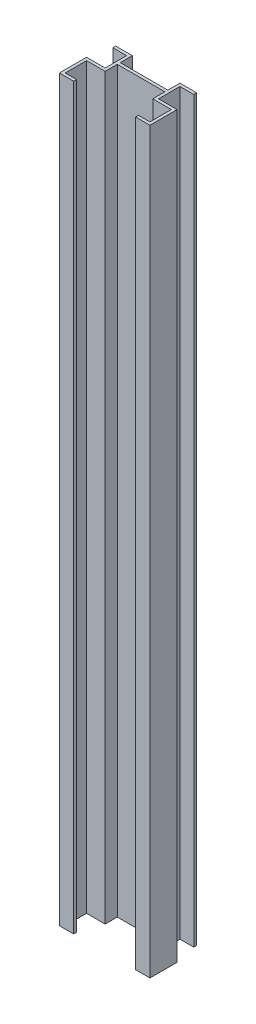
ISO-10303-21;
HEADER;
FILE_DESCRIPTION(('STEP AP214'),'2;1');
FILE_NAME('part.step','',(''),(''),'','','');
FILE_SCHEMA(('AUTOMOTIVE_DESIGN { 1 0 10303 214 1 1 1 1 }'));
ENDSEC;
DATA;
#1=APPLICATION_CONTEXT('core data for automotive mechanical design processes');
#2=APPLICATION_PROTOCOL_DEFINITION('international standard','automotive_design',2000,#1);
#3=PRODUCT_CONTEXT('',#1,'mechanical');
#4=PRODUCT('Part','Part','',(#3));
#5=PRODUCT_RELATED_PRODUCT_CATEGORY('part','',(#4));
#6=PRODUCT_DEFINITION_FORMATION('','',#4);
#7=PRODUCT_DEFINITION_CONTEXT('part definition',#1,'design');
#8=PRODUCT_DEFINITION('design','',#6,#7);
#9=PRODUCT_DEFINITION_SHAPE('','',#8);
#10=(LENGTH_UNIT() NAMED_UNIT(*) SI_UNIT(.MILLI.,.METRE.));
#11=(NAMED_UNIT(*) PLANE_ANGLE_UNIT() SI_UNIT($,.RADIAN.));
#12=(NAMED_UNIT(*) SI_UNIT($,.STERADIAN.) SOLID_ANGLE_UNIT());
#13=UNCERTAINTY_MEASURE_WITH_UNIT(LENGTH_MEASURE(1.E-05),#10,'distance_accuracy_value','');
#14=(GEOMETRIC_REPRESENTATION_CONTEXT(3) GLOBAL_UNCERTAINTY_ASSIGNED_CONTEXT((#13)) GLOBAL_UNIT_ASSIGNED_CONTEXT((#10,
#11,#12)) REPRESENTATION_CONTEXT('',''));
#15=CARTESIAN_POINT('',(0.,0.,0.));
#16=DIRECTION('',(0.,0.,1.));
#17=DIRECTION('',(1.,0.,0.));
#18=AXIS2_PLACEMENT_3D('',#15,#16,#17);
#19=CARTESIAN_POINT('',(-56.,-5.00000001402157E-05,-51.));
#20=DIRECTION('',(1.,0.,0.));
#21=DIRECTION('',(0.,0.,-1.));
#22=AXIS2_PLACEMENT_3D('',#19,#20,#21);
#23=PLANE('',#22);
#24=DIRECTION('',(0.,0.,1.));
#25=VECTOR('',#24,1.);
#26=CARTESIAN_POINT('',(-56.,1550.,-51.));
#27=LINE('',#26,#25);
#28=CARTESIAN_POINT('',(-56.,1550.,-96.));
#29=VERTEX_POINT('',#28);
#30=CARTESIAN_POINT('',(-56.,1550.,-51.));
#31=VERTEX_POINT('',#30);
#32=EDGE_CURVE('E421',#29,#31,#27,.T.);
#33=ORIENTED_EDGE('',*,*,#32,.F.);
#34=DIRECTION('',(0.,1.,0.));
#35=VECTOR('',#34,1.);
#36=CARTESIAN_POINT('',(-56.,2350.,-96.));
#37=LINE('',#36,#35);
#38=CARTESIAN_POINT('',(-56.,0.,-96.));
#39=VERTEX_POINT('',#38);
#40=EDGE_CURVE('E232',#39,#29,#37,.T.);
#41=ORIENTED_EDGE('',*,*,#40,.F.);
#42=DIRECTION('',(0.,0.,1.));
#43=VECTOR('',#42,1.);
#44=CARTESIAN_POINT('',(-56.,0.,-44.9999999999998));
#45=LINE('',#44,#43);
#46=CARTESIAN_POINT('',(-56.,0.,-51.));
#47=VERTEX_POINT('',#46);
#48=EDGE_CURVE('E253',#39,#47,#45,.T.);
#49=ORIENTED_EDGE('',*,*,#48,.T.);
#50=DIRECTION('',(0.,1.,0.));
#51=VECTOR('',#50,1.);
#52=CARTESIAN_POINT('',(-56.,-5.00000001402157E-05,-51.));
#53=LINE('',#52,#51);
#54=EDGE_CURVE('E250',#47,#31,#53,.T.);
#55=ORIENTED_EDGE('',*,*,#54,.T.);
#56=EDGE_LOOP('',(#33,#41,#49,#55));
#57=FACE_BOUND('',#56,.T.);
#58=ADVANCED_FACE('F35',(#57),#23,.F.);
#59=CARTESIAN_POINT('',(0.,0.,-76.5));
#60=DIRECTION('',(0.,0.,-1.));
#61=DIRECTION('',(-1.,0.,0.));
#62=AXIS2_PLACEMENT_3D('',#59,#60,#61);
#63=PLANE('',#62);
#64=DIRECTION('',(0.,-1.,0.));
#65=VECTOR('',#64,1.);
#66=CARTESIAN_POINT('',(-50.0000000000004,0.,-76.5000000000002));
#67=LINE('',#66,#65);
#68=CARTESIAN_POINT('',(-50.,1550.,-76.5000000000002));
#69=VERTEX_POINT('',#68);
#70=CARTESIAN_POINT('',(-50.0000000000004,0.,-76.5000000000002));
#71=VERTEX_POINT('',#70);
#72=EDGE_CURVE('E259',#69,#71,#67,.T.);
#73=ORIENTED_EDGE('',*,*,#72,.F.);
#74=DIRECTION('',(1.,0.,0.));
#75=VECTOR('',#74,1.);
#76=CARTESIAN_POINT('',(0.,1550.,-76.5));
#77=LINE('',#76,#75);
#78=CARTESIAN_POINT('',(49.9999999999997,1550.,-76.4999999999999));
#79=VERTEX_POINT('',#78);
#80=EDGE_CURVE('E425',#69,#79,#77,.T.);
#81=ORIENTED_EDGE('',*,*,#80,.T.);
#82=DIRECTION('',(0.,1.,0.));
#83=VECTOR('',#82,1.);
#84=CARTESIAN_POINT('',(49.9999999999997,2350.,-76.4999999999998));
#85=LINE('',#84,#83);
#86=CARTESIAN_POINT('',(49.9999999999997,0.,-76.5));
#87=VERTEX_POINT('',#86);
#88=EDGE_CURVE('E289',#87,#79,#85,.T.);
#89=ORIENTED_EDGE('',*,*,#88,.F.);
#90=DIRECTION('',(-1.,0.,0.));
#91=VECTOR('',#90,1.);
#92=CARTESIAN_POINT('',(95.,0.,-76.5));
#93=LINE('',#92,#91);
#94=EDGE_CURVE('E375',#87,#71,#93,.T.);
#95=ORIENTED_EDGE('',*,*,#94,.T.);
#96=EDGE_LOOP('',(#73,#81,#89,#95));
#97=FACE_BOUND('',#96,.T.);
#98=ADVANCED_FACE('F504',(#97),#63,.T.);
#99=CARTESIAN_POINT('',(56.,2350.,-51.));
#100=DIRECTION('',(-1.,0.,0.));
#101=DIRECTION('',(0.,0.,1.));
#102=AXIS2_PLACEMENT_3D('',#99,#100,#101);
#103=PLANE('',#102);
#104=DIRECTION('',(0.,0.,-1.));
#105=VECTOR('',#104,1.);
#106=CARTESIAN_POINT('',(56.,1550.,-51.));
#107=LINE('',#106,#105);
#108=CARTESIAN_POINT('',(56.,1550.,-51.));
#109=VERTEX_POINT('',#108);
#110=CARTESIAN_POINT('',(56.,1550.,-96.));
#111=VERTEX_POINT('',#110);
#112=EDGE_CURVE('E455',#109,#111,#107,.T.);
#113=ORIENTED_EDGE('',*,*,#112,.F.);
#114=DIRECTION('',(0.,-1.,0.));
#115=VECTOR('',#114,1.);
#116=CARTESIAN_POINT('',(56.,2350.,-51.));
#117=LINE('',#116,#115);
#118=CARTESIAN_POINT('',(56.,0.,-51.));
#119=VERTEX_POINT('',#118);
#120=EDGE_CURVE('E287',#109,#119,#117,.T.);
#121=ORIENTED_EDGE('',*,*,#120,.T.);
#122=DIRECTION('',(0.,0.,-1.));
#123=VECTOR('',#122,1.);
#124=CARTESIAN_POINT('',(56.,0.,-51.));
#125=LINE('',#124,#123);
#126=CARTESIAN_POINT('',(56.,0.,-96.));
#127=VERTEX_POINT('',#126);
#128=EDGE_CURVE('E284',#119,#127,#125,.T.);
#129=ORIENTED_EDGE('',*,*,#128,.T.);
#130=DIRECTION('',(0.,-1.,0.));
#131=VECTOR('',#130,1.);
#132=CARTESIAN_POINT('',(56.,0.,-96.));
#133=LINE('',#132,#131);
#134=EDGE_CURVE('E57',#111,#127,#133,.T.);
#135=ORIENTED_EDGE('',*,*,#134,.F.);
#136=EDGE_LOOP('',(#113,#121,#129,#135));
#137=FACE_BOUND('',#136,.T.);
#138=ADVANCED_FACE('F496',(#137),#103,.F.);
#139=CARTESIAN_POINT('',(-95.0000000000001,2350.,-70.4999999999997));
#140=DIRECTION('',(0.,0.,-1.));
#141=DIRECTION('',(-1.,0.,0.));
#142=AXIS2_PLACEMENT_3D('',#139,#140,#141);
#143=PLANE('',#142);
#144=DIRECTION('',(1.,0.,0.));
#145=VECTOR('',#144,1.);
#146=CARTESIAN_POINT('',(-95.0000000000001,1550.,-70.4999999999997));
#147=LINE('',#146,#145);
#148=CARTESIAN_POINT('',(-50.,1550.,-70.4999999999999));
#149=VERTEX_POINT('',#148);
#150=CARTESIAN_POINT('',(49.9999999999999,1550.,-70.4999999999997));
#151=VERTEX_POINT('',#150);
#152=EDGE_CURVE('E406',#149,#151,#147,.T.);
#153=ORIENTED_EDGE('',*,*,#152,.F.);
#154=DIRECTION('',(0.,1.,0.));
#155=VECTOR('',#154,1.);
#156=CARTESIAN_POINT('',(-50.,2350.,-70.4999999999997));
#157=LINE('',#156,#155);
#158=CARTESIAN_POINT('',(-50.,0.,-70.4999999999997));
#159=VERTEX_POINT('',#158);
#160=EDGE_CURVE('E347',#159,#149,#157,.T.);
#161=ORIENTED_EDGE('',*,*,#160,.F.);
#162=DIRECTION('',(1.,0.,0.));
#163=VECTOR('',#162,1.);
#164=CARTESIAN_POINT('',(-95.0000000000001,0.,-70.4999999999997));
#165=LINE('',#164,#163);
#166=CARTESIAN_POINT('',(49.9999999999999,0.,-70.4999999999997));
#167=VERTEX_POINT('',#166);
#168=EDGE_CURVE('E361',#159,#167,#165,.T.);
#169=ORIENTED_EDGE('',*,*,#168,.T.);
#170=DIRECTION('',(0.,1.,0.));
#171=VECTOR('',#170,1.);
#172=CARTESIAN_POINT('',(49.9999999999999,2350.,-70.4999999999997));
#173=LINE('',#172,#171);
#174=EDGE_CURVE('E357',#167,#151,#173,.T.);
#175=ORIENTED_EDGE('',*,*,#174,.T.);
#176=EDGE_LOOP('',(#153,#161,#169,#175));
#177=FACE_BOUND('',#176,.T.);
#178=ADVANCED_FACE('F494',(#177),#143,.F.);
#179=CARTESIAN_POINT('',(-50.,2350.,6.00000000000024));
#180=DIRECTION('',(-1.,0.,0.));
#181=DIRECTION('',(0.,0.,1.));
#182=AXIS2_PLACEMENT_3D('',#179,#180,#181);
#183=PLANE('',#182);
#184=DIRECTION('',(0.,0.,-1.));
#185=VECTOR('',#184,1.);
#186=CARTESIAN_POINT('',(-50.,1550.,6.00000000000024));
#187=LINE('',#186,#185);
#188=CARTESIAN_POINT('',(-50.,1550.,-45.));
#189=VERTEX_POINT('',#188);
#190=EDGE_CURVE('E409',#189,#149,#187,.T.);
#191=ORIENTED_EDGE('',*,*,#190,.F.);
#192=DIRECTION('',(0.,1.,0.));
#193=VECTOR('',#192,1.);
#194=CARTESIAN_POINT('',(-50.,0.,-45.));
#195=LINE('',#194,#193);
#196=CARTESIAN_POINT('',(-50.,0.,-45.));
#197=VERTEX_POINT('',#196);
#198=EDGE_CURVE('E306',#197,#189,#195,.T.);
#199=ORIENTED_EDGE('',*,*,#198,.F.);
#200=DIRECTION('',(0.,0.,-1.));
#201=VECTOR('',#200,1.);
#202=CARTESIAN_POINT('',(-50.,0.,6.00000000000024));
#203=LINE('',#202,#201);
#204=EDGE_CURVE('E353',#197,#159,#203,.T.);
#205=ORIENTED_EDGE('',*,*,#204,.T.);
#206=ORIENTED_EDGE('',*,*,#160,.T.);
#207=EDGE_LOOP('',(#191,#199,#205,#206));
#208=FACE_BOUND('',#207,.T.);
#209=ADVANCED_FACE('F490',(#208),#183,.F.);
#210=CARTESIAN_POINT('',(-50.0000000000003,1550.,-102.));
#211=VERTEX_POINT('',#210);
#212=EDGE_CURVE('E428',#69,#211,#187,.T.);
#213=ORIENTED_EDGE('',*,*,#212,.F.);
#214=ORIENTED_EDGE('',*,*,#72,.T.);
#215=DIRECTION('',(0.,0.,1.));
#216=VECTOR('',#215,1.);
#217=CARTESIAN_POINT('',(-50.0000000000003,0.,-102.));
#218=LINE('',#217,#216);
#219=CARTESIAN_POINT('',(-50.0000000000003,0.,-102.));
#220=VERTEX_POINT('',#219);
#221=EDGE_CURVE('E265',#220,#71,#218,.T.);
#222=ORIENTED_EDGE('',*,*,#221,.F.);
#223=DIRECTION('',(0.,-1.,0.));
#224=VECTOR('',#223,1.);
#225=CARTESIAN_POINT('',(-50.0000000000003,0.,-102.));
#226=LINE('',#225,#224);
#227=EDGE_CURVE('E260',#211,#220,#226,.T.);
#228=ORIENTED_EDGE('',*,*,#227,.F.);
#229=EDGE_LOOP('',(#213,#214,#222,#228));
#230=FACE_BOUND('',#229,.T.);
#231=ADVANCED_FACE('F502',(#230),#183,.F.);
#232=CARTESIAN_POINT('',(88.9999999999998,0.,6.00000000000016));
#233=DIRECTION('',(1.,0.,0.));
#234=DIRECTION('',(0.,0.,-1.));
#235=AXIS2_PLACEMENT_3D('',#232,#233,#234);
#236=PLANE('',#235);
#237=DIRECTION('',(0.,0.,1.));
#238=VECTOR('',#237,1.);
#239=CARTESIAN_POINT('',(88.9999999999998,1550.,6.00000000000016));
#240=LINE('',#239,#238);
#241=CARTESIAN_POINT('',(88.9999999999998,1550.,-44.9999999999998));
#242=VERTEX_POINT('',#241);
#243=CARTESIAN_POINT('',(88.9999999999998,1550.,2.00805084366041E-12));
#244=VERTEX_POINT('',#243);
#245=EDGE_CURVE('E431',#242,#244,#240,.T.);
#246=ORIENTED_EDGE('',*,*,#245,.F.);
#247=DIRECTION('',(0.,-1.,0.));
#248=VECTOR('',#247,1.);
#249=CARTESIAN_POINT('',(88.9999999999998,0.,-44.9999999999998));
#250=LINE('',#249,#248);
#251=CARTESIAN_POINT('',(88.9999999999998,0.,-44.9999999999998));
#252=VERTEX_POINT('',#251);
#253=EDGE_CURVE('E336',#242,#252,#250,.T.);
#254=ORIENTED_EDGE('',*,*,#253,.T.);
#255=DIRECTION('',(0.,0.,-1.));
#256=VECTOR('',#255,1.);
#257=CARTESIAN_POINT('',(88.9999999999998,0.,6.00000000000016));
#258=LINE('',#257,#256);
#259=CARTESIAN_POINT('',(88.9999999999998,0.,2.00805084366041E-12));
#260=VERTEX_POINT('',#259);
#261=EDGE_CURVE('E343',#260,#252,#258,.T.);
#262=ORIENTED_EDGE('',*,*,#261,.F.);
#263=DIRECTION('',(0.,-1.,0.));
#264=VECTOR('',#263,1.);
#265=CARTESIAN_POINT('',(88.9999999999998,0.,2.00805084366041E-12));
#266=LINE('',#265,#264);
#267=EDGE_CURVE('E323',#244,#260,#266,.T.);
#268=ORIENTED_EDGE('',*,*,#267,.F.);
#269=EDGE_LOOP('',(#246,#254,#262,#268));
#270=FACE_BOUND('',#269,.T.);
#271=ADVANCED_FACE('F563',(#270),#236,.F.);
#272=CARTESIAN_POINT('',(0.,0.,-44.9999999999998));
#273=DIRECTION('',(0.,0.,-1.));
#274=DIRECTION('',(-1.,0.,0.));
#275=AXIS2_PLACEMENT_3D('',#272,#273,#274);
#276=PLANE('',#275);
#277=DIRECTION('',(1.,0.,0.));
#278=VECTOR('',#277,1.);
#279=CARTESIAN_POINT('',(0.,1550.,-44.9999999999998));
#280=LINE('',#279,#278);
#281=CARTESIAN_POINT('',(49.9999999999999,1550.,-44.9999999999999));
#282=VERTEX_POINT('',#281);
#283=EDGE_CURVE('E241',#282,#242,#280,.T.);
#284=ORIENTED_EDGE('',*,*,#283,.F.);
#285=DIRECTION('',(0.,1.,0.));
#286=VECTOR('',#285,1.);
#287=CARTESIAN_POINT('',(49.9999999999999,0.,-44.9999999999999));
#288=LINE('',#287,#286);
#289=CARTESIAN_POINT('',(49.9999999999999,0.,-44.9999999999999));
#290=VERTEX_POINT('',#289);
#291=EDGE_CURVE('E380',#290,#282,#288,.T.);
#292=ORIENTED_EDGE('',*,*,#291,.F.);
#293=DIRECTION('',(-1.,0.,0.));
#294=VECTOR('',#293,1.);
#295=CARTESIAN_POINT('',(95.,0.,-44.9999999999999));
#296=LINE('',#295,#294);
#297=EDGE_CURVE('E364',#252,#290,#296,.T.);
#298=ORIENTED_EDGE('',*,*,#297,.F.);
#299=ORIENTED_EDGE('',*,*,#253,.F.);
#300=EDGE_LOOP('',(#284,#292,#298,#299));
#301=FACE_BOUND('',#300,.T.);
#302=ADVANCED_FACE('F403',(#301),#276,.F.);
#303=CARTESIAN_POINT('',(95.,2350.,-44.9999999999999));
#304=DIRECTION('',(1.,0.,0.));
#305=DIRECTION('',(0.,0.,-1.));
#306=AXIS2_PLACEMENT_3D('',#303,#304,#305);
#307=PLANE('',#306);
#308=DIRECTION('',(0.,-1.,0.));
#309=VECTOR('',#308,1.);
#310=CARTESIAN_POINT('',(95.,2350.,-51.));
#311=LINE('',#310,#309);
#312=CARTESIAN_POINT('',(95.,1550.,-51.));
#313=VERTEX_POINT('',#312);
#314=CARTESIAN_POINT('',(95.,0.,-51.));
#315=VERTEX_POINT('',#314);
#316=EDGE_CURVE('E286',#313,#315,#311,.T.);
#317=ORIENTED_EDGE('',*,*,#316,.F.);
#318=DIRECTION('',(0.,0.,1.));
#319=VECTOR('',#318,1.);
#320=CARTESIAN_POINT('',(95.,1550.,-44.9999999999999));
#321=LINE('',#320,#319);
#322=CARTESIAN_POINT('',(95.,1550.,6.00000000000016));
#323=VERTEX_POINT('',#322);
#324=EDGE_CURVE('E448',#313,#323,#321,.T.);
#325=ORIENTED_EDGE('',*,*,#324,.T.);
#326=DIRECTION('',(0.,1.,0.));
#327=VECTOR('',#326,1.);
#328=CARTESIAN_POINT('',(94.9999999999998,2350.,6.00000000000016));
#329=LINE('',#328,#327);
#330=CARTESIAN_POINT('',(94.9999999999998,0.,6.00000000000016));
#331=VERTEX_POINT('',#330);
#332=EDGE_CURVE('E340',#331,#323,#329,.T.);
#333=ORIENTED_EDGE('',*,*,#332,.F.);
#334=DIRECTION('',(0.,0.,-1.));
#335=VECTOR('',#334,1.);
#336=CARTESIAN_POINT('',(95.,0.,-44.9999999999999));
#337=LINE('',#336,#335);
#338=EDGE_CURVE('E382',#331,#315,#337,.T.);
#339=ORIENTED_EDGE('',*,*,#338,.T.);
#340=EDGE_LOOP('',(#317,#325,#333,#339));
#341=FACE_BOUND('',#340,.T.);
#342=ADVANCED_FACE('F37',(#341),#307,.T.);
#343=CARTESIAN_POINT('',(49.9999999999999,0.,-44.9999999999999));
#344=DIRECTION('',(-1.,0.,0.));
#345=DIRECTION('',(0.,0.,1.));
#346=AXIS2_PLACEMENT_3D('',#343,#344,#345);
#347=PLANE('',#346);
#348=ORIENTED_EDGE('',*,*,#291,.T.);
#349=DIRECTION('',(0.,0.,-1.));
#350=VECTOR('',#349,1.);
#351=CARTESIAN_POINT('',(49.9999999999999,1550.,-44.9999999999999));
#352=LINE('',#351,#350);
#353=EDGE_CURVE('E405',#282,#151,#352,.T.);
#354=ORIENTED_EDGE('',*,*,#353,.T.);
#355=ORIENTED_EDGE('',*,*,#174,.F.);
#356=DIRECTION('',(0.,0.,-1.));
#357=VECTOR('',#356,1.);
#358=CARTESIAN_POINT('',(49.9999999999999,0.,-44.9999999999999));
#359=LINE('',#358,#357);
#360=EDGE_CURVE('E43',#290,#167,#359,.T.);
#361=ORIENTED_EDGE('',*,*,#360,.F.);
#362=EDGE_LOOP('',(#348,#354,#355,#361));
#363=FACE_BOUND('',#362,.T.);
#364=ADVANCED_FACE('F401',(#363),#347,.T.);
#365=ORIENTED_EDGE('',*,*,#88,.T.);
#366=CARTESIAN_POINT('',(49.9999999999999,1550.,-102.));
#367=VERTEX_POINT('',#366);
#368=EDGE_CURVE('E408',#79,#367,#352,.T.);
#369=ORIENTED_EDGE('',*,*,#368,.T.);
#370=DIRECTION('',(0.,1.,0.));
#371=VECTOR('',#370,1.);
#372=CARTESIAN_POINT('',(49.9999999999998,2350.,-102.));
#373=LINE('',#372,#371);
#374=CARTESIAN_POINT('',(49.9999999999998,0.,-102.));
#375=VERTEX_POINT('',#374);
#376=EDGE_CURVE('E293',#375,#367,#373,.T.);
#377=ORIENTED_EDGE('',*,*,#376,.F.);
#378=DIRECTION('',(0.,0.,1.));
#379=VECTOR('',#378,1.);
#380=CARTESIAN_POINT('',(49.9999999999998,0.,-102.));
#381=LINE('',#380,#379);
#382=EDGE_CURVE('E296',#375,#87,#381,.T.);
#383=ORIENTED_EDGE('',*,*,#382,.T.);
#384=EDGE_LOOP('',(#365,#369,#377,#383));
#385=FACE_BOUND('',#384,.T.);
#386=ADVANCED_FACE('F570',(#385),#347,.T.);
#387=CARTESIAN_POINT('',(-95.,0.,0.));
#388=DIRECTION('',(1.,0.,0.));
#389=DIRECTION('',(0.,0.,-1.));
#390=AXIS2_PLACEMENT_3D('',#387,#388,#389);
#391=PLANE('',#390);
#392=DIRECTION('',(0.,0.,1.));
#393=VECTOR('',#392,1.);
#394=CARTESIAN_POINT('',(-95.,1550.,0.));
#395=LINE('',#394,#393);
#396=CARTESIAN_POINT('',(-95.,1550.,-51.));
#397=VERTEX_POINT('',#396);
#398=CARTESIAN_POINT('',(-95.,1550.,6.00000000000024));
#399=VERTEX_POINT('',#398);
#400=EDGE_CURVE('E414',#397,#399,#395,.T.);
#401=ORIENTED_EDGE('',*,*,#400,.F.);
#402=DIRECTION('',(0.,1.,0.));
#403=VECTOR('',#402,1.);
#404=CARTESIAN_POINT('',(-95.,-5.00000001402157E-05,-51.));
#405=LINE('',#404,#403);
#406=CARTESIAN_POINT('',(-95.,0.,-51.));
#407=VERTEX_POINT('',#406);
#408=EDGE_CURVE('E249',#407,#397,#405,.T.);
#409=ORIENTED_EDGE('',*,*,#408,.F.);
#410=DIRECTION('',(0.,0.,1.));
#411=VECTOR('',#410,1.);
#412=CARTESIAN_POINT('',(-95.0000000000001,0.,-70.4999999999997));
#413=LINE('',#412,#411);
#414=CARTESIAN_POINT('',(-95.,0.,6.00000000000024));
#415=VERTEX_POINT('',#414);
#416=EDGE_CURVE('E358',#407,#415,#413,.T.);
#417=ORIENTED_EDGE('',*,*,#416,.T.);
#418=DIRECTION('',(0.,-1.,0.));
#419=VECTOR('',#418,1.);
#420=CARTESIAN_POINT('',(-95.,0.,6.00000000000024));
#421=LINE('',#420,#419);
#422=EDGE_CURVE('E348',#399,#415,#421,.T.);
#423=ORIENTED_EDGE('',*,*,#422,.F.);
#424=EDGE_LOOP('',(#401,#409,#417,#423));
#425=FACE_BOUND('',#424,.T.);
#426=ADVANCED_FACE('F568',(#425),#391,.F.);
#427=CARTESIAN_POINT('',(0.,0.,6.00000000000024));
#428=DIRECTION('',(0.,0.,-1.));
#429=DIRECTION('',(-1.,0.,0.));
#430=AXIS2_PLACEMENT_3D('',#427,#428,#429);
#431=PLANE('',#430);
#432=DIRECTION('',(1.,0.,0.));
#433=VECTOR('',#432,1.);
#434=CARTESIAN_POINT('',(0.,1550.,6.00000000000024));
#435=LINE('',#434,#433);
#436=CARTESIAN_POINT('',(-65.,1550.,6.00000000000024));
#437=VERTEX_POINT('',#436);
#438=EDGE_CURVE('E417',#399,#437,#435,.T.);
#439=ORIENTED_EDGE('',*,*,#438,.F.);
#440=ORIENTED_EDGE('',*,*,#422,.T.);
#441=DIRECTION('',(1.,0.,0.));
#442=VECTOR('',#441,1.);
#443=CARTESIAN_POINT('',(-50.,0.,6.00000000000024));
#444=LINE('',#443,#442);
#445=CARTESIAN_POINT('',(-65.,0.,6.00000000000024));
#446=VERTEX_POINT('',#445);
#447=EDGE_CURVE('E350',#415,#446,#444,.T.);
#448=ORIENTED_EDGE('',*,*,#447,.T.);
#449=DIRECTION('',(0.,-1.,0.));
#450=VECTOR('',#449,1.);
#451=CARTESIAN_POINT('',(-65.,2350.,6.00000000000024));
#452=LINE('',#451,#450);
#453=EDGE_CURVE('E316',#437,#446,#452,.T.);
#454=ORIENTED_EDGE('',*,*,#453,.F.);
#455=EDGE_LOOP('',(#439,#440,#448,#454));
#456=FACE_BOUND('',#455,.T.);
#457=ADVANCED_FACE('F472',(#456),#431,.F.);
#458=CARTESIAN_POINT('',(0.,0.,6.00000000000016));
#459=DIRECTION('',(0.,0.,-1.));
#460=DIRECTION('',(-1.,0.,0.));
#461=AXIS2_PLACEMENT_3D('',#458,#459,#460);
#462=PLANE('',#461);
#463=DIRECTION('',(1.,0.,0.));
#464=VECTOR('',#463,1.);
#465=CARTESIAN_POINT('',(0.,1550.,6.00000000000016));
#466=LINE('',#465,#464);
#467=CARTESIAN_POINT('',(64.9999999999998,1550.,6.00000000000016));
#468=VERTEX_POINT('',#467);
#469=EDGE_CURVE('E444',#468,#323,#466,.T.);
#470=ORIENTED_EDGE('',*,*,#469,.F.);
#471=DIRECTION('',(0.,1.,0.));
#472=VECTOR('',#471,1.);
#473=CARTESIAN_POINT('',(64.9999999999998,2350.,6.));
#474=LINE('',#473,#472);
#475=CARTESIAN_POINT('',(64.9999999999998,0.,6.));
#476=VERTEX_POINT('',#475);
#477=EDGE_CURVE('E324',#476,#468,#474,.T.);
#478=ORIENTED_EDGE('',*,*,#477,.F.);
#479=DIRECTION('',(1.,0.,0.));
#480=VECTOR('',#479,1.);
#481=CARTESIAN_POINT('',(94.9999999999998,0.,6.00000000000016));
#482=LINE('',#481,#480);
#483=EDGE_CURVE('E337',#476,#331,#482,.T.);
#484=ORIENTED_EDGE('',*,*,#483,.T.);
#485=ORIENTED_EDGE('',*,*,#332,.T.);
#486=EDGE_LOOP('',(#470,#478,#484,#485));
#487=FACE_BOUND('',#486,.T.);
#488=ADVANCED_FACE('F558',(#487),#462,.F.);
#489=CARTESIAN_POINT('',(64.9999999999998,0.,2.00805084366041E-12));
#490=DIRECTION('',(0.,0.,1.));
#491=DIRECTION('',(1.,0.,0.));
#492=AXIS2_PLACEMENT_3D('',#489,#490,#491);
#493=PLANE('',#492);
#494=DIRECTION('',(-1.,0.,0.));
#495=VECTOR('',#494,1.);
#496=CARTESIAN_POINT('',(64.9999999999998,1550.,2.00805084366041E-12));
#497=LINE('',#496,#495);
#498=CARTESIAN_POINT('',(64.9999999999998,1550.,2.0080508436604E-12));
#499=VERTEX_POINT('',#498);
#500=EDGE_CURVE('E434',#244,#499,#497,.T.);
#501=ORIENTED_EDGE('',*,*,#500,.F.);
#502=ORIENTED_EDGE('',*,*,#267,.T.);
#503=DIRECTION('',(1.,0.,0.));
#504=VECTOR('',#503,1.);
#505=CARTESIAN_POINT('',(64.9999999999998,0.,2.00805084366041E-12));
#506=LINE('',#505,#504);
#507=CARTESIAN_POINT('',(64.9999999999998,0.,2.00805084366041E-12));
#508=VERTEX_POINT('',#507);
#509=EDGE_CURVE('E332',#508,#260,#506,.T.);
#510=ORIENTED_EDGE('',*,*,#509,.F.);
#511=DIRECTION('',(0.,-1.,0.));
#512=VECTOR('',#511,1.);
#513=CARTESIAN_POINT('',(64.9999999999998,0.,2.00805084366041E-12));
#514=LINE('',#513,#512);
#515=EDGE_CURVE('E327',#499,#508,#514,.T.);
#516=ORIENTED_EDGE('',*,*,#515,.F.);
#517=EDGE_LOOP('',(#501,#502,#510,#516));
#518=FACE_BOUND('',#517,.T.);
#519=ADVANCED_FACE('F554',(#518),#493,.F.);
#520=CARTESIAN_POINT('',(64.9999999999998,0.,0.));
#521=DIRECTION('',(1.,0.,0.));
#522=DIRECTION('',(0.,0.,-1.));
#523=AXIS2_PLACEMENT_3D('',#520,#521,#522);
#524=PLANE('',#523);
#525=DIRECTION('',(0.,0.,1.));
#526=VECTOR('',#525,1.);
#527=CARTESIAN_POINT('',(64.9999999999998,1550.,0.));
#528=LINE('',#527,#526);
#529=EDGE_CURVE('E437',#499,#468,#528,.T.);
#530=ORIENTED_EDGE('',*,*,#529,.F.);
#531=ORIENTED_EDGE('',*,*,#515,.T.);
#532=DIRECTION('',(0.,0.,1.));
#533=VECTOR('',#532,1.);
#534=CARTESIAN_POINT('',(64.9999999999998,0.,6.));
#535=LINE('',#534,#533);
#536=EDGE_CURVE('E329',#508,#476,#535,.T.);
#537=ORIENTED_EDGE('',*,*,#536,.T.);
#538=ORIENTED_EDGE('',*,*,#477,.T.);
#539=EDGE_LOOP('',(#530,#531,#537,#538));
#540=FACE_BOUND('',#539,.T.);
#541=ADVANCED_FACE('F551',(#540),#524,.F.);
#542=CARTESIAN_POINT('',(-65.,2350.,5.27355936696949E-13));
#543=DIRECTION('',(-1.,0.,0.));
#544=DIRECTION('',(0.,0.,1.));
#545=AXIS2_PLACEMENT_3D('',#542,#543,#544);
#546=PLANE('',#545);
#547=DIRECTION('',(0.,0.,-1.));
#548=VECTOR('',#547,1.);
#549=CARTESIAN_POINT('',(-65.,1550.,5.27355936696949E-13));
#550=LINE('',#549,#548);
#551=CARTESIAN_POINT('',(-65.,1550.,0.));
#552=VERTEX_POINT('',#551);
#553=EDGE_CURVE('E457',#437,#552,#550,.T.);
#554=ORIENTED_EDGE('',*,*,#553,.F.);
#555=ORIENTED_EDGE('',*,*,#453,.T.);
#556=DIRECTION('',(0.,0.,1.));
#557=VECTOR('',#556,1.);
#558=CARTESIAN_POINT('',(-65.,0.,5.27355936696949E-13));
#559=LINE('',#558,#557);
#560=CARTESIAN_POINT('',(-65.,0.,0.));
#561=VERTEX_POINT('',#560);
#562=EDGE_CURVE('E319',#561,#446,#559,.T.);
#563=ORIENTED_EDGE('',*,*,#562,.F.);
#564=DIRECTION('',(0.,-1.,0.));
#565=VECTOR('',#564,1.);
#566=CARTESIAN_POINT('',(-65.,2350.,5.27355936696949E-13));
#567=LINE('',#566,#565);
#568=EDGE_CURVE('E317',#552,#561,#567,.T.);
#569=ORIENTED_EDGE('',*,*,#568,.F.);
#570=EDGE_LOOP('',(#554,#555,#563,#569));
#571=FACE_BOUND('',#570,.T.);
#572=ADVANCED_FACE('F470',(#571),#546,.F.);
#573=CARTESIAN_POINT('',(0.,0.,0.));
#574=DIRECTION('',(0.,0.,1.));
#575=DIRECTION('',(1.,0.,0.));
#576=AXIS2_PLACEMENT_3D('',#573,#574,#575);
#577=PLANE('',#576);
#578=DIRECTION('',(-1.,0.,0.));
#579=VECTOR('',#578,1.);
#580=CARTESIAN_POINT('',(0.,1550.,0.));
#581=LINE('',#580,#579);
#582=CARTESIAN_POINT('',(-89.,1550.,0.));
#583=VERTEX_POINT('',#582);
#584=EDGE_CURVE('E451',#552,#583,#581,.T.);
#585=ORIENTED_EDGE('',*,*,#584,.F.);
#586=ORIENTED_EDGE('',*,*,#568,.T.);
#587=DIRECTION('',(1.,0.,0.));
#588=VECTOR('',#587,1.);
#589=CARTESIAN_POINT('',(-89.,0.,0.));
#590=LINE('',#589,#588);
#591=CARTESIAN_POINT('',(-89.,0.,0.));
#592=VERTEX_POINT('',#591);
#593=EDGE_CURVE('E304',#592,#561,#590,.T.);
#594=ORIENTED_EDGE('',*,*,#593,.F.);
#595=DIRECTION('',(0.,-1.,0.));
#596=VECTOR('',#595,1.);
#597=CARTESIAN_POINT('',(-89.,2350.,0.));
#598=LINE('',#597,#596);
#599=EDGE_CURVE('E310',#583,#592,#598,.T.);
#600=ORIENTED_EDGE('',*,*,#599,.F.);
#601=EDGE_LOOP('',(#585,#586,#594,#600));
#602=FACE_BOUND('',#601,.T.);
#603=ADVANCED_FACE('F481',(#602),#577,.F.);
#604=CARTESIAN_POINT('',(-89.,2350.,-45.));
#605=DIRECTION('',(-1.,0.,0.));
#606=DIRECTION('',(0.,0.,1.));
#607=AXIS2_PLACEMENT_3D('',#604,#605,#606);
#608=PLANE('',#607);
#609=DIRECTION('',(0.,0.,-1.));
#610=VECTOR('',#609,1.);
#611=CARTESIAN_POINT('',(-89.,1550.,-45.));
#612=LINE('',#611,#610);
#613=CARTESIAN_POINT('',(-89.,1550.,-45.));
#614=VERTEX_POINT('',#613);
#615=EDGE_CURVE('E446',#583,#614,#612,.T.);
#616=ORIENTED_EDGE('',*,*,#615,.F.);
#617=ORIENTED_EDGE('',*,*,#599,.T.);
#618=DIRECTION('',(0.,0.,1.));
#619=VECTOR('',#618,1.);
#620=CARTESIAN_POINT('',(-89.,0.,-45.));
#621=LINE('',#620,#619);
#622=CARTESIAN_POINT('',(-89.,0.,-45.));
#623=VERTEX_POINT('',#622);
#624=EDGE_CURVE('E309',#623,#592,#621,.T.);
#625=ORIENTED_EDGE('',*,*,#624,.F.);
#626=DIRECTION('',(0.,-1.,0.));
#627=VECTOR('',#626,1.);
#628=CARTESIAN_POINT('',(-89.,2350.,-45.));
#629=LINE('',#628,#627);
#630=EDGE_CURVE('E301',#614,#623,#629,.T.);
#631=ORIENTED_EDGE('',*,*,#630,.F.);
#632=EDGE_LOOP('',(#616,#617,#625,#631));
#633=FACE_BOUND('',#632,.T.);
#634=ADVANCED_FACE('F485',(#633),#608,.F.);
#635=CARTESIAN_POINT('',(0.,0.,-45.));
#636=DIRECTION('',(0.,0.,1.));
#637=DIRECTION('',(1.,0.,0.));
#638=AXIS2_PLACEMENT_3D('',#635,#636,#637);
#639=PLANE('',#638);
#640=ORIENTED_EDGE('',*,*,#198,.T.);
#641=DIRECTION('',(-1.,0.,0.));
#642=VECTOR('',#641,1.);
#643=CARTESIAN_POINT('',(0.,1550.,-45.));
#644=LINE('',#643,#642);
#645=EDGE_CURVE('E441',#189,#614,#644,.T.);
#646=ORIENTED_EDGE('',*,*,#645,.T.);
#647=ORIENTED_EDGE('',*,*,#630,.T.);
#648=DIRECTION('',(1.,0.,0.));
#649=VECTOR('',#648,1.);
#650=CARTESIAN_POINT('',(-89.,0.,-45.));
#651=LINE('',#650,#649);
#652=EDGE_CURVE('E303',#623,#197,#651,.T.);
#653=ORIENTED_EDGE('',*,*,#652,.T.);
#654=EDGE_LOOP('',(#640,#646,#647,#653));
#655=FACE_BOUND('',#654,.T.);
#656=ADVANCED_FACE('F487',(#655),#639,.T.);
#657=CARTESIAN_POINT('',(3.77475828372553E-13,0.,-102.));
#658=DIRECTION('',(0.,0.,1.));
#659=DIRECTION('',(1.,0.,0.));
#660=AXIS2_PLACEMENT_3D('',#657,#658,#659);
#661=PLANE('',#660);
#662=DIRECTION('',(-1.,0.,0.));
#663=VECTOR('',#662,1.);
#664=CARTESIAN_POINT('',(3.77475828372553E-13,1550.,-102.));
#665=LINE('',#664,#663);
#666=CARTESIAN_POINT('',(85.,1550.,-102.));
#667=VERTEX_POINT('',#666);
#668=EDGE_CURVE('E413',#667,#367,#665,.T.);
#669=ORIENTED_EDGE('',*,*,#668,.F.);
#670=DIRECTION('',(0.,1.,0.));
#671=VECTOR('',#670,1.);
#672=CARTESIAN_POINT('',(85.,2350.,-102.));
#673=LINE('',#672,#671);
#674=CARTESIAN_POINT('',(85.,0.,-102.));
#675=VERTEX_POINT('',#674);
#676=EDGE_CURVE('E269',#675,#667,#673,.T.);
#677=ORIENTED_EDGE('',*,*,#676,.F.);
#678=DIRECTION('',(-1.,0.,0.));
#679=VECTOR('',#678,1.);
#680=CARTESIAN_POINT('',(49.9999999999998,0.,-102.));
#681=LINE('',#680,#679);
#682=EDGE_CURVE('E291',#675,#375,#681,.T.);
#683=ORIENTED_EDGE('',*,*,#682,.T.);
#684=ORIENTED_EDGE('',*,*,#376,.T.);
#685=EDGE_LOOP('',(#669,#677,#683,#684));
#686=FACE_BOUND('',#685,.T.);
#687=ADVANCED_FACE('F538',(#686),#661,.F.);
#688=CARTESIAN_POINT('',(95.,2350.,-51.));
#689=DIRECTION('',(0.,0.,1.));
#690=DIRECTION('',(1.,0.,0.));
#691=AXIS2_PLACEMENT_3D('',#688,#689,#690);
#692=PLANE('',#691);
#693=DIRECTION('',(-1.,0.,0.));
#694=VECTOR('',#693,1.);
#695=CARTESIAN_POINT('',(95.,1550.,-51.));
#696=LINE('',#695,#694);
#697=EDGE_CURVE('E453',#313,#109,#696,.T.);
#698=ORIENTED_EDGE('',*,*,#697,.F.);
#699=ORIENTED_EDGE('',*,*,#316,.T.);
#700=DIRECTION('',(-1.,0.,0.));
#701=VECTOR('',#700,1.);
#702=CARTESIAN_POINT('',(95.,0.,-51.));
#703=LINE('',#702,#701);
#704=EDGE_CURVE('E281',#315,#119,#703,.T.);
#705=ORIENTED_EDGE('',*,*,#704,.T.);
#706=ORIENTED_EDGE('',*,*,#120,.F.);
#707=EDGE_LOOP('',(#698,#699,#705,#706));
#708=FACE_BOUND('',#707,.T.);
#709=ADVANCED_FACE('F534',(#708),#692,.F.);
#710=CARTESIAN_POINT('',(85.,0.,-96.));
#711=DIRECTION('',(0.,0.,-1.));
#712=DIRECTION('',(-1.,0.,0.));
#713=AXIS2_PLACEMENT_3D('',#710,#711,#712);
#714=PLANE('',#713);
#715=DIRECTION('',(1.,0.,0.));
#716=VECTOR('',#715,1.);
#717=CARTESIAN_POINT('',(85.,1550.,-96.));
#718=LINE('',#717,#716);
#719=CARTESIAN_POINT('',(85.,1550.,-96.));
#720=VERTEX_POINT('',#719);
#721=EDGE_CURVE('E459',#111,#720,#718,.T.);
#722=ORIENTED_EDGE('',*,*,#721,.F.);
#723=ORIENTED_EDGE('',*,*,#134,.T.);
#724=DIRECTION('',(-1.,0.,0.));
#725=VECTOR('',#724,1.);
#726=CARTESIAN_POINT('',(85.,0.,-96.));
#727=LINE('',#726,#725);
#728=CARTESIAN_POINT('',(85.,0.,-96.));
#729=VERTEX_POINT('',#728);
#730=EDGE_CURVE('E277',#729,#127,#727,.T.);
#731=ORIENTED_EDGE('',*,*,#730,.F.);
#732=DIRECTION('',(0.,-1.,0.));
#733=VECTOR('',#732,1.);
#734=CARTESIAN_POINT('',(85.,0.,-96.));
#735=LINE('',#734,#733);
#736=EDGE_CURVE('E272',#720,#729,#735,.T.);
#737=ORIENTED_EDGE('',*,*,#736,.F.);
#738=EDGE_LOOP('',(#722,#723,#731,#737));
#739=FACE_BOUND('',#738,.T.);
#740=ADVANCED_FACE('F531',(#739),#714,.F.);
#741=CARTESIAN_POINT('',(85.,0.,0.));
#742=DIRECTION('',(-1.,0.,0.));
#743=DIRECTION('',(0.,0.,1.));
#744=AXIS2_PLACEMENT_3D('',#741,#742,#743);
#745=PLANE('',#744);
#746=DIRECTION('',(0.,0.,-1.));
#747=VECTOR('',#746,1.);
#748=CARTESIAN_POINT('',(85.,1550.,0.));
#749=LINE('',#748,#747);
#750=EDGE_CURVE('E461',#720,#667,#749,.T.);
#751=ORIENTED_EDGE('',*,*,#750,.F.);
#752=ORIENTED_EDGE('',*,*,#736,.T.);
#753=DIRECTION('',(0.,0.,-1.));
#754=VECTOR('',#753,1.);
#755=CARTESIAN_POINT('',(85.,0.,-102.));
#756=LINE('',#755,#754);
#757=EDGE_CURVE('E274',#729,#675,#756,.T.);
#758=ORIENTED_EDGE('',*,*,#757,.T.);
#759=ORIENTED_EDGE('',*,*,#676,.T.);
#760=EDGE_LOOP('',(#751,#752,#758,#759));
#761=FACE_BOUND('',#760,.T.);
#762=ADVANCED_FACE('F527',(#761),#745,.F.);
#763=CARTESIAN_POINT('',(3.77475828372553E-13,0.,-102.));
#764=DIRECTION('',(0.,0.,1.));
#765=DIRECTION('',(1.,0.,0.));
#766=AXIS2_PLACEMENT_3D('',#763,#764,#765);
#767=PLANE('',#766);
#768=DIRECTION('',(-1.,0.,0.));
#769=VECTOR('',#768,1.);
#770=CARTESIAN_POINT('',(3.77475828372553E-13,1550.,-102.));
#771=LINE('',#770,#769);
#772=CARTESIAN_POINT('',(-85.,1550.,-102.));
#773=VERTEX_POINT('',#772);
#774=EDGE_CURVE('E49',#211,#773,#771,.T.);
#775=ORIENTED_EDGE('',*,*,#774,.F.);
#776=ORIENTED_EDGE('',*,*,#227,.T.);
#777=DIRECTION('',(-1.,0.,0.));
#778=VECTOR('',#777,1.);
#779=CARTESIAN_POINT('',(-95.0000000000003,0.,-102.));
#780=LINE('',#779,#778);
#781=CARTESIAN_POINT('',(-85.,0.,-102.));
#782=VERTEX_POINT('',#781);
#783=EDGE_CURVE('E262',#220,#782,#780,.T.);
#784=ORIENTED_EDGE('',*,*,#783,.T.);
#785=DIRECTION('',(0.,-1.,0.));
#786=VECTOR('',#785,1.);
#787=CARTESIAN_POINT('',(-85.,0.,-102.));
#788=LINE('',#787,#786);
#789=EDGE_CURVE('E238',#773,#782,#788,.T.);
#790=ORIENTED_EDGE('',*,*,#789,.F.);
#791=EDGE_LOOP('',(#775,#776,#784,#790));
#792=FACE_BOUND('',#791,.T.);
#793=ADVANCED_FACE('F523',(#792),#767,.F.);
#794=CARTESIAN_POINT('',(-95.,-5.00000001402157E-05,-51.));
#795=DIRECTION('',(0.,0.,1.));
#796=DIRECTION('',(1.,0.,0.));
#797=AXIS2_PLACEMENT_3D('',#794,#795,#796);
#798=PLANE('',#797);
#799=DIRECTION('',(-1.,0.,0.));
#800=VECTOR('',#799,1.);
#801=CARTESIAN_POINT('',(-95.,1550.,-51.));
#802=LINE('',#801,#800);
#803=EDGE_CURVE('E418',#31,#397,#802,.T.);
#804=ORIENTED_EDGE('',*,*,#803,.F.);
#805=ORIENTED_EDGE('',*,*,#54,.F.);
#806=DIRECTION('',(-1.,0.,0.));
#807=VECTOR('',#806,1.);
#808=CARTESIAN_POINT('',(95.,0.,-51.));
#809=LINE('',#808,#807);
#810=EDGE_CURVE('E257',#47,#407,#809,.T.);
#811=ORIENTED_EDGE('',*,*,#810,.T.);
#812=ORIENTED_EDGE('',*,*,#408,.T.);
#813=EDGE_LOOP('',(#804,#805,#811,#812));
#814=FACE_BOUND('',#813,.T.);
#815=ADVANCED_FACE('F520',(#814),#798,.F.);
#816=CARTESIAN_POINT('',(-85.,2350.,-96.));
#817=DIRECTION('',(0.,0.,-1.));
#818=DIRECTION('',(-1.,0.,0.));
#819=AXIS2_PLACEMENT_3D('',#816,#817,#818);
#820=PLANE('',#819);
#821=DIRECTION('',(1.,0.,0.));
#822=VECTOR('',#821,1.);
#823=CARTESIAN_POINT('',(-85.,1550.,-96.));
#824=LINE('',#823,#822);
#825=CARTESIAN_POINT('',(-85.,1550.,-96.));
#826=VERTEX_POINT('',#825);
#827=EDGE_CURVE('E220',#826,#29,#824,.T.);
#828=ORIENTED_EDGE('',*,*,#827,.F.);
#829=DIRECTION('',(0.,1.,0.));
#830=VECTOR('',#829,1.);
#831=CARTESIAN_POINT('',(-85.,2350.,-96.));
#832=LINE('',#831,#830);
#833=CARTESIAN_POINT('',(-85.,0.,-96.));
#834=VERTEX_POINT('',#833);
#835=EDGE_CURVE('E230',#834,#826,#832,.T.);
#836=ORIENTED_EDGE('',*,*,#835,.F.);
#837=DIRECTION('',(1.,0.,0.));
#838=VECTOR('',#837,1.);
#839=CARTESIAN_POINT('',(-85.,0.,-96.));
#840=LINE('',#839,#838);
#841=EDGE_CURVE('E246',#834,#39,#840,.T.);
#842=ORIENTED_EDGE('',*,*,#841,.T.);
#843=ORIENTED_EDGE('',*,*,#40,.T.);
#844=EDGE_LOOP('',(#828,#836,#842,#843));
#845=FACE_BOUND('',#844,.T.);
#846=ADVANCED_FACE('F228',(#845),#820,.F.);
#847=CARTESIAN_POINT('',(-85.,0.,0.));
#848=DIRECTION('',(1.,0.,0.));
#849=DIRECTION('',(0.,0.,-1.));
#850=AXIS2_PLACEMENT_3D('',#847,#848,#849);
#851=PLANE('',#850);
#852=DIRECTION('',(0.,0.,1.));
#853=VECTOR('',#852,1.);
#854=CARTESIAN_POINT('',(-85.,1550.,0.));
#855=LINE('',#854,#853);
#856=EDGE_CURVE('E11',#773,#826,#855,.T.);
#857=ORIENTED_EDGE('',*,*,#856,.F.);
#858=ORIENTED_EDGE('',*,*,#789,.T.);
#859=DIRECTION('',(0.,0.,1.));
#860=VECTOR('',#859,1.);
#861=CARTESIAN_POINT('',(-85.,0.,-96.));
#862=LINE('',#861,#860);
#863=EDGE_CURVE('E236',#782,#834,#862,.T.);
#864=ORIENTED_EDGE('',*,*,#863,.T.);
#865=ORIENTED_EDGE('',*,*,#835,.T.);
#866=EDGE_LOOP('',(#857,#858,#864,#865));
#867=FACE_BOUND('',#866,.T.);
#868=ADVANCED_FACE('F234',(#867),#851,.F.);
#869=CARTESIAN_POINT('',(95.,0.,-44.9999999999999));
#870=DIRECTION('',(0.,-1.,0.));
#871=DIRECTION('',(0.,0.,-1.));
#872=AXIS2_PLACEMENT_3D('',#869,#870,#871);
#873=PLANE('',#872);
#874=ORIENTED_EDGE('',*,*,#48,.F.);
#875=ORIENTED_EDGE('',*,*,#841,.F.);
#876=ORIENTED_EDGE('',*,*,#863,.F.);
#877=ORIENTED_EDGE('',*,*,#783,.F.);
#878=ORIENTED_EDGE('',*,*,#221,.T.);
#879=ORIENTED_EDGE('',*,*,#94,.F.);
#880=ORIENTED_EDGE('',*,*,#382,.F.);
#881=ORIENTED_EDGE('',*,*,#682,.F.);
#882=ORIENTED_EDGE('',*,*,#757,.F.);
#883=ORIENTED_EDGE('',*,*,#730,.T.);
#884=ORIENTED_EDGE('',*,*,#128,.F.);
#885=ORIENTED_EDGE('',*,*,#704,.F.);
#886=ORIENTED_EDGE('',*,*,#338,.F.);
#887=ORIENTED_EDGE('',*,*,#483,.F.);
#888=ORIENTED_EDGE('',*,*,#536,.F.);
#889=ORIENTED_EDGE('',*,*,#509,.T.);
#890=ORIENTED_EDGE('',*,*,#261,.T.);
#891=ORIENTED_EDGE('',*,*,#297,.T.);
#892=ORIENTED_EDGE('',*,*,#360,.T.);
#893=ORIENTED_EDGE('',*,*,#168,.F.);
#894=ORIENTED_EDGE('',*,*,#204,.F.);
#895=ORIENTED_EDGE('',*,*,#652,.F.);
#896=ORIENTED_EDGE('',*,*,#624,.T.);
#897=ORIENTED_EDGE('',*,*,#593,.T.);
#898=ORIENTED_EDGE('',*,*,#562,.T.);
#899=ORIENTED_EDGE('',*,*,#447,.F.);
#900=ORIENTED_EDGE('',*,*,#416,.F.);
#901=ORIENTED_EDGE('',*,*,#810,.F.);
#902=EDGE_LOOP('',(#874,#875,#876,#877,#878,#879,#880,#881,#882,#883,#884,#885,#886,#887,#888,
#889,#890,#891,#892,#893,#894,#895,#896,#897,#898,#899,#900,#901));
#903=FACE_BOUND('',#902,.T.);
#904=ADVANCED_FACE('F395',(#903),#873,.T.);
#905=CARTESIAN_POINT('',(0.,1550.,0.));
#906=DIRECTION('',(0.,1.,0.));
#907=DIRECTION('',(0.,0.,1.));
#908=AXIS2_PLACEMENT_3D('',#905,#906,#907);
#909=PLANE('',#908);
#910=ORIENTED_EDGE('',*,*,#283,.T.);
#911=ORIENTED_EDGE('',*,*,#245,.T.);
#912=ORIENTED_EDGE('',*,*,#500,.T.);
#913=ORIENTED_EDGE('',*,*,#529,.T.);
#914=ORIENTED_EDGE('',*,*,#469,.T.);
#915=ORIENTED_EDGE('',*,*,#324,.F.);
#916=ORIENTED_EDGE('',*,*,#697,.T.);
#917=ORIENTED_EDGE('',*,*,#112,.T.);
#918=ORIENTED_EDGE('',*,*,#721,.T.);
#919=ORIENTED_EDGE('',*,*,#750,.T.);
#920=ORIENTED_EDGE('',*,*,#668,.T.);
#921=ORIENTED_EDGE('',*,*,#368,.F.);
#922=ORIENTED_EDGE('',*,*,#80,.F.);
#923=ORIENTED_EDGE('',*,*,#212,.T.);
#924=ORIENTED_EDGE('',*,*,#774,.T.);
#925=ORIENTED_EDGE('',*,*,#856,.T.);
#926=ORIENTED_EDGE('',*,*,#827,.T.);
#927=ORIENTED_EDGE('',*,*,#32,.T.);
#928=ORIENTED_EDGE('',*,*,#803,.T.);
#929=ORIENTED_EDGE('',*,*,#400,.T.);
#930=ORIENTED_EDGE('',*,*,#438,.T.);
#931=ORIENTED_EDGE('',*,*,#553,.T.);
#932=ORIENTED_EDGE('',*,*,#584,.T.);
#933=ORIENTED_EDGE('',*,*,#615,.T.);
#934=ORIENTED_EDGE('',*,*,#645,.F.);
#935=ORIENTED_EDGE('',*,*,#190,.T.);
#936=ORIENTED_EDGE('',*,*,#152,.T.);
#937=ORIENTED_EDGE('',*,*,#353,.F.);
#938=EDGE_LOOP('',(#910,#911,#912,#913,#914,#915,#916,#917,#918,#919,#920,#921,#922,#923,#924,
#925,#926,#927,#928,#929,#930,#931,#932,#933,#934,#935,#936,#937));
#939=FACE_BOUND('',#938,.T.);
#940=ADVANCED_FACE('F219',(#939),#909,.T.);
#941=CLOSED_SHELL('',(#58,#98,#138,#178,#209,#231,#271,#302,#342,#364,#386,#426,#457,#488,#519,
#541,#572,#603,#634,#656,#687,#709,#740,#762,#793,#815,#846,#868,#904,#940));
#942=MANIFOLD_SOLID_BREP('B2',#941);
#943=ADVANCED_BREP_SHAPE_REPRESENTATION('',(#18,#942),#14);
#944=SHAPE_DEFINITION_REPRESENTATION(#9,#943);
ENDSEC;
END-ISO-10303-21;
